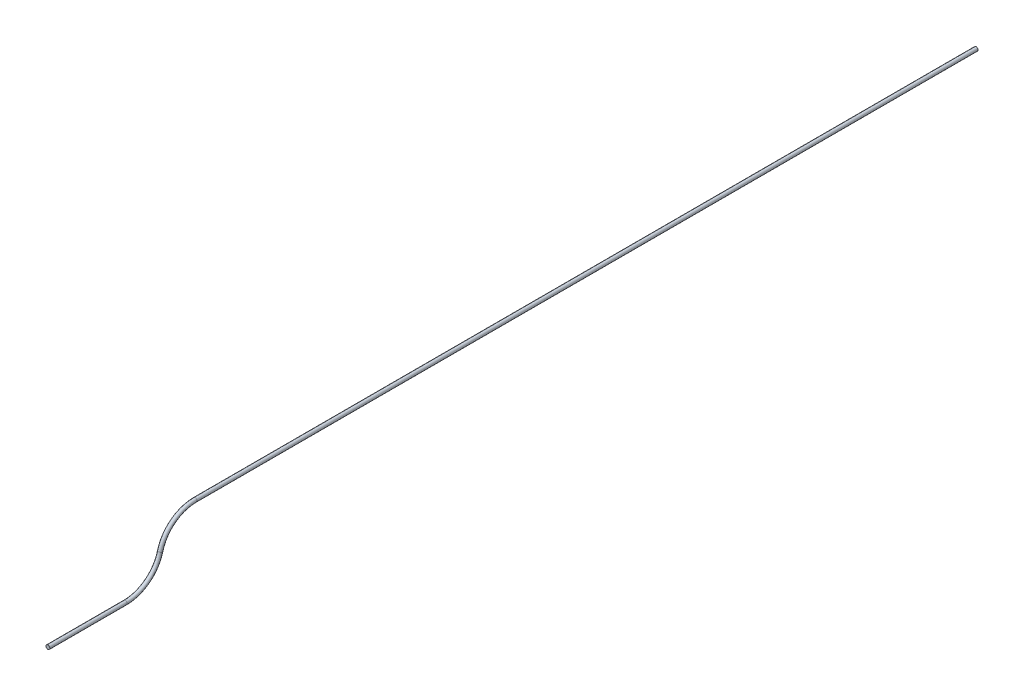
ISO-10303-21;
HEADER;
FILE_DESCRIPTION(('STEP AP214'),'2;1');
FILE_NAME('part.step','',(''),(''),'','','');
FILE_SCHEMA(('AUTOMOTIVE_DESIGN { 1 0 10303 214 1 1 1 1 }'));
ENDSEC;
DATA;
#1=APPLICATION_CONTEXT('core data for automotive mechanical design processes');
#2=APPLICATION_PROTOCOL_DEFINITION('international standard','automotive_design',2000,#1);
#3=PRODUCT_CONTEXT('',#1,'mechanical');
#4=PRODUCT('Part','Part','',(#3));
#5=PRODUCT_RELATED_PRODUCT_CATEGORY('part','',(#4));
#6=PRODUCT_DEFINITION_FORMATION('','',#4);
#7=PRODUCT_DEFINITION_CONTEXT('part definition',#1,'design');
#8=PRODUCT_DEFINITION('design','',#6,#7);
#9=PRODUCT_DEFINITION_SHAPE('','',#8);
#10=(LENGTH_UNIT() NAMED_UNIT(*) SI_UNIT(.MILLI.,.METRE.));
#11=(NAMED_UNIT(*) PLANE_ANGLE_UNIT() SI_UNIT($,.RADIAN.));
#12=(NAMED_UNIT(*) SI_UNIT($,.STERADIAN.) SOLID_ANGLE_UNIT());
#13=UNCERTAINTY_MEASURE_WITH_UNIT(LENGTH_MEASURE(1.E-05),#10,'distance_accuracy_value','');
#14=(GEOMETRIC_REPRESENTATION_CONTEXT(3) GLOBAL_UNCERTAINTY_ASSIGNED_CONTEXT((#13)) GLOBAL_UNIT_ASSIGNED_CONTEXT((#10,
#11,#12)) REPRESENTATION_CONTEXT('',''));
#15=CARTESIAN_POINT('',(0.,0.,0.));
#16=DIRECTION('',(0.,0.,1.));
#17=DIRECTION('',(1.,0.,0.));
#18=AXIS2_PLACEMENT_3D('',#15,#16,#17);
#19=CARTESIAN_POINT('',(0.,114.3,-311.060665490503));
#20=DIRECTION('',(0.,0.,-1.));
#21=DIRECTION('',(-1.,0.,0.));
#22=AXIS2_PLACEMENT_3D('',#19,#20,#21);
#23=CYLINDRICAL_SURFACE('',#22,4.03225);
#24=CARTESIAN_POINT('',(0.,114.3,-311.060665490503));
#25=DIRECTION('',(0.,0.,1.));
#26=DIRECTION('',(1.,0.,0.));
#27=AXIS2_PLACEMENT_3D('',#24,#25,#26);
#28=CIRCLE('',#27,4.03225);
#29=CARTESIAN_POINT('',(0.,118.33225,-311.060665490503));
#30=VERTEX_POINT('',#29);
#31=EDGE_CURVE('E47',#30,#30,#28,.T.);
#32=ORIENTED_EDGE('',*,*,#31,.F.);
#33=EDGE_LOOP('',(#32));
#34=FACE_BOUND('',#33,.T.);
#35=CARTESIAN_POINT('',(0.,114.3,-1962.0606654905));
#36=DIRECTION('',(0.,0.,1.));
#37=DIRECTION('',(1.,0.,0.));
#38=AXIS2_PLACEMENT_3D('',#35,#36,#37);
#39=CIRCLE('',#38,4.03225);
#40=CARTESIAN_POINT('',(4.03225,114.3,-1962.0606654905));
#41=VERTEX_POINT('',#40);
#42=EDGE_CURVE('E10',#41,#41,#39,.T.);
#43=ORIENTED_EDGE('',*,*,#42,.T.);
#44=EDGE_LOOP('',(#43));
#45=FACE_BOUND('',#44,.T.);
#46=ADVANCED_FACE('F41',(#34,#45),#23,.T.);
#47=CARTESIAN_POINT('',(0.,38.1,-311.060665490503));
#48=DIRECTION('',(-1.,0.,0.));
#49=DIRECTION('',(0.,0.,1.));
#50=AXIS2_PLACEMENT_3D('',#47,#48,#49);
#51=TOROIDAL_SURFACE('',#50,76.2,4.03225);
#52=CARTESIAN_POINT('',(0.,57.15,-237.280332745251));
#53=DIRECTION('',(0.,-0.968245836551854,0.25));
#54=DIRECTION('',(1.,0.,0.));
#55=AXIS2_PLACEMENT_3D('',#52,#53,#54);
#56=CIRCLE('',#55,4.03225);
#57=CARTESIAN_POINT('',(0.,58.1580625,-233.376123470815));
#58=VERTEX_POINT('',#57);
#59=EDGE_CURVE('E52',#58,#58,#56,.T.);
#60=CARTESIAN_POINT('',(0.,38.1,-311.060665490503));
#61=DIRECTION('',(-1.,0.,0.));
#62=DIRECTION('',(0.,0.,1.));
#63=AXIS2_PLACEMENT_3D('',#60,#61,#62);
#64=CIRCLE('',#63,80.23225);
#65=EDGE_CURVE('',#58,#30,#64,.T.);
#66=ORIENTED_EDGE('',*,*,#59,.F.);
#67=ORIENTED_EDGE('',*,*,#31,.T.);
#68=ORIENTED_EDGE('',*,*,#65,.T.);
#69=ORIENTED_EDGE('',*,*,#65,.F.);
#70=EDGE_LOOP('',(#66,#68,#67,#69));
#71=FACE_BOUND('',#70,.T.);
#72=ADVANCED_FACE('F74',(#71),#51,.T.);
#73=CARTESIAN_POINT('',(0.,76.2,-163.5));
#74=DIRECTION('',(1.,0.,0.));
#75=DIRECTION('',(0.,0.,-1.));
#76=AXIS2_PLACEMENT_3D('',#73,#74,#75);
#77=TOROIDAL_SURFACE('',#76,76.2,4.03225);
#78=CARTESIAN_POINT('',(0.,0.,-163.5));
#79=DIRECTION('',(0.,0.,1.));
#80=DIRECTION('',(1.,0.,0.));
#81=AXIS2_PLACEMENT_3D('',#78,#79,#80);
#82=CIRCLE('',#81,4.03225);
#83=CARTESIAN_POINT('',(4.03225,0.,-163.5));
#84=VERTEX_POINT('',#83);
#85=EDGE_CURVE('E57',#84,#84,#82,.T.);
#86=ORIENTED_EDGE('',*,*,#85,.F.);
#87=EDGE_LOOP('',(#86));
#88=FACE_BOUND('',#87,.T.);
#89=ORIENTED_EDGE('',*,*,#59,.T.);
#90=EDGE_LOOP('',(#89));
#91=FACE_BOUND('',#90,.T.);
#92=ADVANCED_FACE('F71',(#88,#91),#77,.T.);
#93=CARTESIAN_POINT('',(0.,0.,-163.5));
#94=DIRECTION('',(0.,0.,1.));
#95=DIRECTION('',(1.,0.,0.));
#96=AXIS2_PLACEMENT_3D('',#93,#94,#95);
#97=CYLINDRICAL_SURFACE('',#96,4.03225);
#98=ORIENTED_EDGE('',*,*,#85,.T.);
#99=EDGE_LOOP('',(#98));
#100=FACE_BOUND('',#99,.T.);
#101=CARTESIAN_POINT('',(0.,0.,0.));
#102=DIRECTION('',(0.,0.,1.));
#103=DIRECTION('',(1.,0.,0.));
#104=AXIS2_PLACEMENT_3D('',#101,#102,#103);
#105=CIRCLE('',#104,4.03225);
#106=CARTESIAN_POINT('',(4.03225,0.,0.));
#107=VERTEX_POINT('',#106);
#108=EDGE_CURVE('E60',#107,#107,#105,.T.);
#109=ORIENTED_EDGE('',*,*,#108,.F.);
#110=EDGE_LOOP('',(#109));
#111=FACE_BOUND('',#110,.T.);
#112=ADVANCED_FACE('F68',(#100,#111),#97,.T.);
#113=CARTESIAN_POINT('',(0.,114.3,-1962.0606654905));
#114=DIRECTION('',(0.,0.,1.));
#115=DIRECTION('',(1.,0.,0.));
#116=AXIS2_PLACEMENT_3D('',#113,#114,#115);
#117=PLANE('',#116);
#118=ORIENTED_EDGE('',*,*,#42,.F.);
#119=EDGE_LOOP('',(#118));
#120=FACE_BOUND('',#119,.T.);
#121=ADVANCED_FACE('F86',(#120),#117,.F.);
#122=CARTESIAN_POINT('',(0.,0.,0.));
#123=DIRECTION('',(0.,0.,1.));
#124=DIRECTION('',(1.,0.,0.));
#125=AXIS2_PLACEMENT_3D('',#122,#123,#124);
#126=PLANE('',#125);
#127=ORIENTED_EDGE('',*,*,#108,.T.);
#128=EDGE_LOOP('',(#127));
#129=FACE_BOUND('',#128,.T.);
#130=ADVANCED_FACE('F87',(#129),#126,.T.);
#131=CLOSED_SHELL('',(#46,#72,#92,#112,#121,#130));
#132=MANIFOLD_SOLID_BREP('B2',#131);
#133=ADVANCED_BREP_SHAPE_REPRESENTATION('',(#18,#132),#14);
#134=SHAPE_DEFINITION_REPRESENTATION(#9,#133);
ENDSEC;
END-ISO-10303-21;
